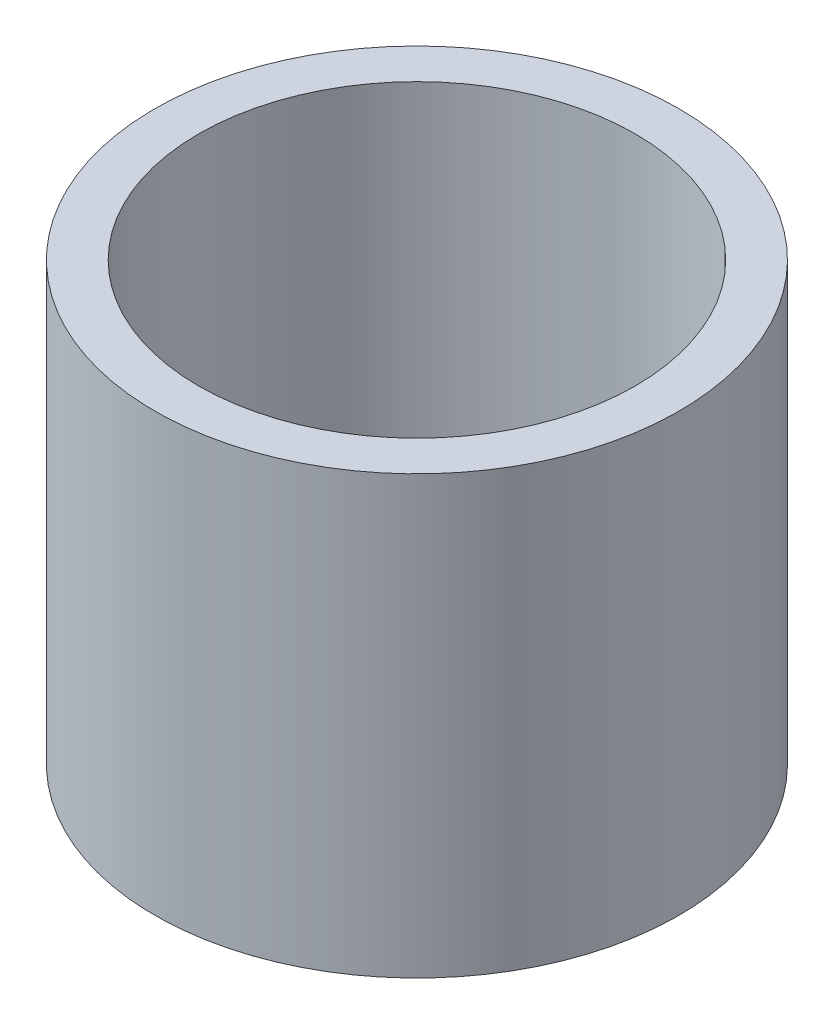
ISO-10303-21;
HEADER;
FILE_DESCRIPTION(('STEP AP214'),'2;1');
FILE_NAME('part.step','',(''),(''),'','','');
FILE_SCHEMA(('AUTOMOTIVE_DESIGN { 1 0 10303 214 1 1 1 1 }'));
ENDSEC;
DATA;
#1=APPLICATION_CONTEXT('core data for automotive mechanical design processes');
#2=APPLICATION_PROTOCOL_DEFINITION('international standard','automotive_design',2000,#1);
#3=PRODUCT_CONTEXT('',#1,'mechanical');
#4=PRODUCT('Part','Part','',(#3));
#5=PRODUCT_RELATED_PRODUCT_CATEGORY('part','',(#4));
#6=PRODUCT_DEFINITION_FORMATION('','',#4);
#7=PRODUCT_DEFINITION_CONTEXT('part definition',#1,'design');
#8=PRODUCT_DEFINITION('design','',#6,#7);
#9=PRODUCT_DEFINITION_SHAPE('','',#8);
#10=(LENGTH_UNIT() NAMED_UNIT(*) SI_UNIT(.MILLI.,.METRE.));
#11=(NAMED_UNIT(*) PLANE_ANGLE_UNIT() SI_UNIT($,.RADIAN.));
#12=(NAMED_UNIT(*) SI_UNIT($,.STERADIAN.) SOLID_ANGLE_UNIT());
#13=UNCERTAINTY_MEASURE_WITH_UNIT(LENGTH_MEASURE(1.E-05),#10,'distance_accuracy_value','');
#14=(GEOMETRIC_REPRESENTATION_CONTEXT(3) GLOBAL_UNCERTAINTY_ASSIGNED_CONTEXT((#13)) GLOBAL_UNIT_ASSIGNED_CONTEXT((#10,
#11,#12)) REPRESENTATION_CONTEXT('',''));
#15=CARTESIAN_POINT('',(0.,0.,0.));
#16=DIRECTION('',(0.,0.,1.));
#17=DIRECTION('',(1.,0.,0.));
#18=AXIS2_PLACEMENT_3D('',#15,#16,#17);
#19=CARTESIAN_POINT('',(0.,-15.8877551020408,0.));
#20=DIRECTION('',(0.,-1.,0.));
#21=DIRECTION('',(0.,0.,-1.));
#22=AXIS2_PLACEMENT_3D('',#19,#20,#21);
#23=CYLINDRICAL_SURFACE('',#22,6.);
#24=CARTESIAN_POINT('',(0.,0.,0.));
#25=DIRECTION('',(0.,-1.,0.));
#26=DIRECTION('',(0.,0.,-1.));
#27=AXIS2_PLACEMENT_3D('',#24,#25,#26);
#28=CIRCLE('',#27,6.);
#29=CARTESIAN_POINT('',(0.,0.,-6.));
#30=VERTEX_POINT('',#29);
#31=EDGE_CURVE('E10',#30,#30,#28,.T.);
#32=ORIENTED_EDGE('',*,*,#31,.F.);
#33=EDGE_LOOP('',(#32));
#34=FACE_BOUND('',#33,.T.);
#35=CARTESIAN_POINT('',(0.,10.,0.));
#36=DIRECTION('',(0.,-1.,0.));
#37=DIRECTION('',(0.,0.,-1.));
#38=AXIS2_PLACEMENT_3D('',#35,#36,#37);
#39=CIRCLE('',#38,6.);
#40=CARTESIAN_POINT('',(0.,10.,-6.));
#41=VERTEX_POINT('',#40);
#42=EDGE_CURVE('E44',#41,#41,#39,.T.);
#43=ORIENTED_EDGE('',*,*,#42,.T.);
#44=EDGE_LOOP('',(#43));
#45=FACE_BOUND('',#44,.T.);
#46=ADVANCED_FACE('F30',(#34,#45),#23,.T.);
#47=CARTESIAN_POINT('',(-6.,0.,0.));
#48=DIRECTION('',(0.,1.,0.));
#49=DIRECTION('',(0.,0.,1.));
#50=AXIS2_PLACEMENT_3D('',#47,#48,#49);
#51=PLANE('',#50);
#52=CARTESIAN_POINT('',(0.,0.,0.));
#53=DIRECTION('',(0.,-1.,0.));
#54=DIRECTION('',(0.,0.,-1.));
#55=AXIS2_PLACEMENT_3D('',#52,#53,#54);
#56=CIRCLE('',#55,5.);
#57=CARTESIAN_POINT('',(0.,0.,-5.));
#58=VERTEX_POINT('',#57);
#59=EDGE_CURVE('E36',#58,#58,#56,.T.);
#60=ORIENTED_EDGE('',*,*,#59,.F.);
#61=EDGE_LOOP('',(#60));
#62=FACE_BOUND('',#61,.T.);
#63=ORIENTED_EDGE('',*,*,#31,.T.);
#64=EDGE_LOOP('',(#63));
#65=FACE_BOUND('',#64,.T.);
#66=ADVANCED_FACE('F59',(#62,#65),#51,.F.);
#67=CARTESIAN_POINT('',(0.,-15.8877551020408,0.));
#68=DIRECTION('',(0.,-1.,0.));
#69=DIRECTION('',(0.,0.,-1.));
#70=AXIS2_PLACEMENT_3D('',#67,#68,#69);
#71=CYLINDRICAL_SURFACE('',#70,5.);
#72=CARTESIAN_POINT('',(0.,10.,0.));
#73=DIRECTION('',(0.,-1.,0.));
#74=DIRECTION('',(0.,0.,-1.));
#75=AXIS2_PLACEMENT_3D('',#72,#73,#74);
#76=CIRCLE('',#75,5.);
#77=CARTESIAN_POINT('',(0.,10.,-5.));
#78=VERTEX_POINT('',#77);
#79=EDGE_CURVE('E40',#78,#78,#76,.T.);
#80=ORIENTED_EDGE('',*,*,#79,.F.);
#81=EDGE_LOOP('',(#80));
#82=FACE_BOUND('',#81,.T.);
#83=ORIENTED_EDGE('',*,*,#59,.T.);
#84=EDGE_LOOP('',(#83));
#85=FACE_BOUND('',#84,.T.);
#86=ADVANCED_FACE('F54',(#82,#85),#71,.F.);
#87=CARTESIAN_POINT('',(-5.,10.,0.));
#88=DIRECTION('',(0.,-1.,0.));
#89=DIRECTION('',(0.,0.,-1.));
#90=AXIS2_PLACEMENT_3D('',#87,#88,#89);
#91=PLANE('',#90);
#92=ORIENTED_EDGE('',*,*,#42,.F.);
#93=EDGE_LOOP('',(#92));
#94=FACE_BOUND('',#93,.T.);
#95=ORIENTED_EDGE('',*,*,#79,.T.);
#96=EDGE_LOOP('',(#95));
#97=FACE_BOUND('',#96,.T.);
#98=ADVANCED_FACE('F51',(#94,#97),#91,.F.);
#99=CLOSED_SHELL('',(#46,#66,#86,#98));
#100=MANIFOLD_SOLID_BREP('B2',#99);
#101=ADVANCED_BREP_SHAPE_REPRESENTATION('',(#18,#100),#14);
#102=SHAPE_DEFINITION_REPRESENTATION(#9,#101);
ENDSEC;
END-ISO-10303-21;
